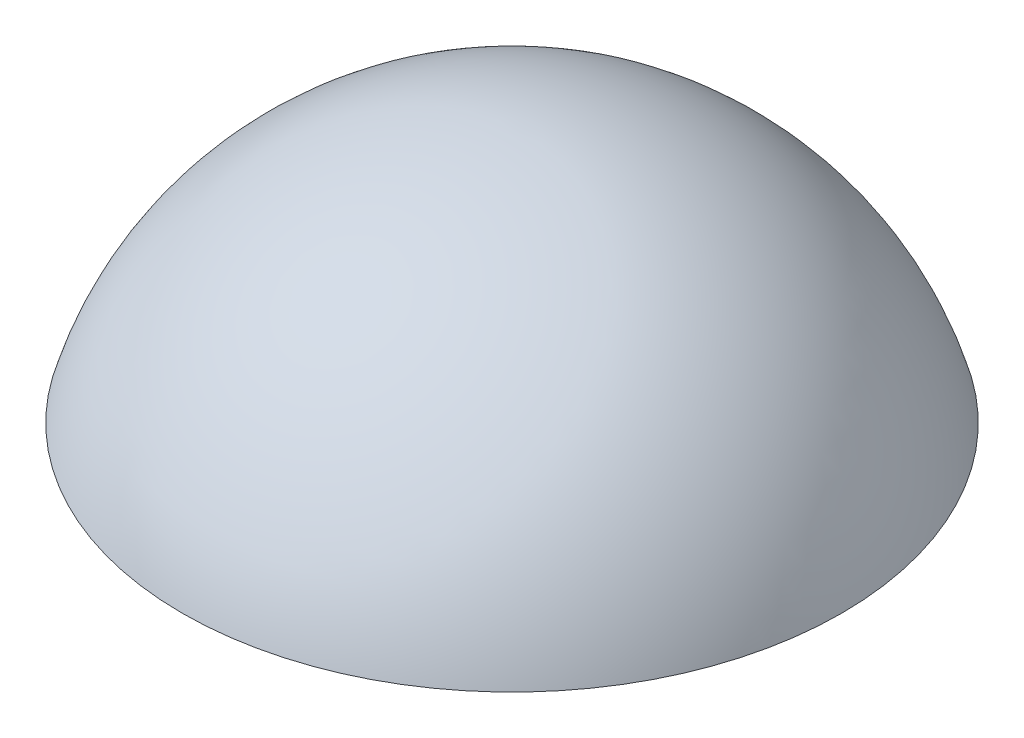
ISO-10303-21;
HEADER;
FILE_DESCRIPTION(('STEP AP214'),'2;1');
FILE_NAME('part.step','',(''),(''),'','','');
FILE_SCHEMA(('AUTOMOTIVE_DESIGN { 1 0 10303 214 1 1 1 1 }'));
ENDSEC;
DATA;
#1=APPLICATION_CONTEXT('core data for automotive mechanical design processes');
#2=APPLICATION_PROTOCOL_DEFINITION('international standard','automotive_design',2000,#1);
#3=PRODUCT_CONTEXT('',#1,'mechanical');
#4=PRODUCT('Part','Part','',(#3));
#5=PRODUCT_RELATED_PRODUCT_CATEGORY('part','',(#4));
#6=PRODUCT_DEFINITION_FORMATION('','',#4);
#7=PRODUCT_DEFINITION_CONTEXT('part definition',#1,'design');
#8=PRODUCT_DEFINITION('design','',#6,#7);
#9=PRODUCT_DEFINITION_SHAPE('','',#8);
#10=(LENGTH_UNIT() NAMED_UNIT(*) SI_UNIT(.MILLI.,.METRE.));
#11=(NAMED_UNIT(*) PLANE_ANGLE_UNIT() SI_UNIT($,.RADIAN.));
#12=(NAMED_UNIT(*) SI_UNIT($,.STERADIAN.) SOLID_ANGLE_UNIT());
#13=UNCERTAINTY_MEASURE_WITH_UNIT(LENGTH_MEASURE(1.E-05),#10,'distance_accuracy_value','');
#14=(GEOMETRIC_REPRESENTATION_CONTEXT(3) GLOBAL_UNCERTAINTY_ASSIGNED_CONTEXT((#13)) GLOBAL_UNIT_ASSIGNED_CONTEXT((#10,
#11,#12)) REPRESENTATION_CONTEXT('',''));
#15=CARTESIAN_POINT('',(0.,0.,0.));
#16=DIRECTION('',(0.,0.,1.));
#17=DIRECTION('',(1.,0.,0.));
#18=AXIS2_PLACEMENT_3D('',#15,#16,#17);
#19=CARTESIAN_POINT('',(0.,-0.986320754716982,0.));
#20=DIRECTION('',(0.,-1.,0.));
#21=DIRECTION('',(1.,0.,0.));
#22=AXIS2_PLACEMENT_3D('',#19,#20,#21);
#23=SPHERICAL_SURFACE('',#22,3.63632075471698);
#24=CARTESIAN_POINT('',(0.,0.,0.));
#25=DIRECTION('',(0.,-1.,0.));
#26=DIRECTION('',(0.,0.,-1.));
#27=AXIS2_PLACEMENT_3D('',#24,#25,#26);
#28=CIRCLE('',#27,3.5);
#29=CARTESIAN_POINT('',(0.,0.,-3.5));
#30=VERTEX_POINT('',#29);
#31=EDGE_CURVE('E10',#30,#30,#28,.T.);
#32=ORIENTED_EDGE('',*,*,#31,.F.);
#33=EDGE_LOOP('',(#32));
#34=FACE_BOUND('',#33,.T.);
#35=ADVANCED_FACE('F31',(#34),#23,.T.);
#36=CARTESIAN_POINT('',(0.,0.,0.));
#37=DIRECTION('',(0.,1.,0.));
#38=DIRECTION('',(0.,0.,1.));
#39=AXIS2_PLACEMENT_3D('',#36,#37,#38);
#40=PLANE('',#39);
#41=ORIENTED_EDGE('',*,*,#31,.T.);
#42=EDGE_LOOP('',(#41));
#43=FACE_BOUND('',#42,.T.);
#44=ADVANCED_FACE('F38',(#43),#40,.F.);
#45=CLOSED_SHELL('',(#35,#44));
#46=MANIFOLD_SOLID_BREP('B2',#45);
#47=ADVANCED_BREP_SHAPE_REPRESENTATION('',(#18,#46),#14);
#48=SHAPE_DEFINITION_REPRESENTATION(#9,#47);
ENDSEC;
END-ISO-10303-21;
